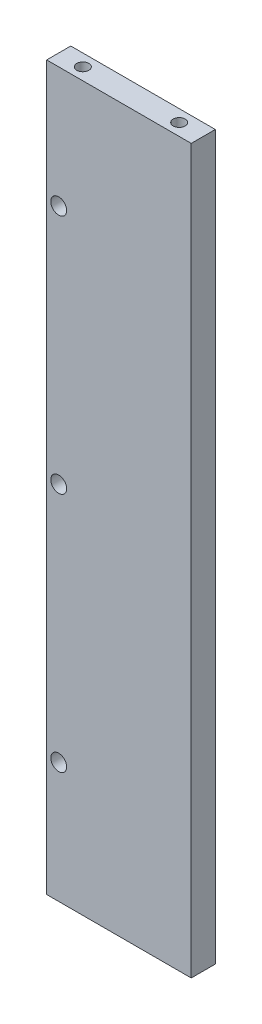
ISO-10303-21;
HEADER;
FILE_DESCRIPTION(('STEP AP214'),'2;1');
FILE_NAME('part.step','',(''),(''),'','','');
FILE_SCHEMA(('AUTOMOTIVE_DESIGN { 1 0 10303 214 1 1 1 1 }'));
ENDSEC;
DATA;
#1=APPLICATION_CONTEXT('core data for automotive mechanical design processes');
#2=APPLICATION_PROTOCOL_DEFINITION('international standard','automotive_design',2000,#1);
#3=PRODUCT_CONTEXT('',#1,'mechanical');
#4=PRODUCT('Part','Part','',(#3));
#5=PRODUCT_RELATED_PRODUCT_CATEGORY('part','',(#4));
#6=PRODUCT_DEFINITION_FORMATION('','',#4);
#7=PRODUCT_DEFINITION_CONTEXT('part definition',#1,'design');
#8=PRODUCT_DEFINITION('design','',#6,#7);
#9=PRODUCT_DEFINITION_SHAPE('','',#8);
#10=(LENGTH_UNIT() NAMED_UNIT(*) SI_UNIT(.MILLI.,.METRE.));
#11=(NAMED_UNIT(*) PLANE_ANGLE_UNIT() SI_UNIT($,.RADIAN.));
#12=(NAMED_UNIT(*) SI_UNIT($,.STERADIAN.) SOLID_ANGLE_UNIT());
#13=UNCERTAINTY_MEASURE_WITH_UNIT(LENGTH_MEASURE(1.E-05),#10,'distance_accuracy_value','');
#14=(GEOMETRIC_REPRESENTATION_CONTEXT(3) GLOBAL_UNCERTAINTY_ASSIGNED_CONTEXT((#13)) GLOBAL_UNIT_ASSIGNED_CONTEXT((#10,
#11,#12)) REPRESENTATION_CONTEXT('',''));
#15=CARTESIAN_POINT('',(0.,0.,0.));
#16=DIRECTION('',(0.,0.,1.));
#17=DIRECTION('',(1.,0.,0.));
#18=AXIS2_PLACEMENT_3D('',#15,#16,#17);
#19=CARTESIAN_POINT('',(0.,0.,10.));
#20=DIRECTION('',(1.,0.,0.));
#21=DIRECTION('',(0.,0.,-1.));
#22=AXIS2_PLACEMENT_3D('',#19,#20,#21);
#23=PLANE('',#22);
#24=DIRECTION('',(0.,-1.,0.));
#25=VECTOR('',#24,1.);
#26=CARTESIAN_POINT('',(0.,0.,0.));
#27=LINE('',#26,#25);
#28=CARTESIAN_POINT('',(0.,300.,0.));
#29=VERTEX_POINT('',#28);
#30=CARTESIAN_POINT('',(0.,0.,0.));
#31=VERTEX_POINT('',#30);
#32=EDGE_CURVE('E136',#29,#31,#27,.T.);
#33=ORIENTED_EDGE('',*,*,#32,.T.);
#34=DIRECTION('',(0.,0.,-1.));
#35=VECTOR('',#34,1.);
#36=CARTESIAN_POINT('',(0.,0.,10.));
#37=LINE('',#36,#35);
#38=CARTESIAN_POINT('',(0.,0.,10.));
#39=VERTEX_POINT('',#38);
#40=EDGE_CURVE('E11',#39,#31,#37,.T.);
#41=ORIENTED_EDGE('',*,*,#40,.F.);
#42=DIRECTION('',(0.,-1.,0.));
#43=VECTOR('',#42,1.);
#44=CARTESIAN_POINT('',(0.,0.,10.));
#45=LINE('',#44,#43);
#46=CARTESIAN_POINT('',(0.,300.,10.));
#47=VERTEX_POINT('',#46);
#48=EDGE_CURVE('E137',#47,#39,#45,.T.);
#49=ORIENTED_EDGE('',*,*,#48,.F.);
#50=DIRECTION('',(0.,0.,-1.));
#51=VECTOR('',#50,1.);
#52=CARTESIAN_POINT('',(0.,300.,10.));
#53=LINE('',#52,#51);
#54=EDGE_CURVE('E143',#47,#29,#53,.T.);
#55=ORIENTED_EDGE('',*,*,#54,.T.);
#56=EDGE_LOOP('',(#33,#41,#49,#55));
#57=FACE_BOUND('',#56,.T.);
#58=ADVANCED_FACE('F41',(#57),#23,.F.);
#59=CARTESIAN_POINT('',(0.,0.,10.));
#60=DIRECTION('',(0.,1.,0.));
#61=DIRECTION('',(0.,0.,1.));
#62=AXIS2_PLACEMENT_3D('',#59,#60,#61);
#63=PLANE('',#62);
#64=CARTESIAN_POINT('',(50.,0.,5.));
#65=DIRECTION('',(0.,-1.,0.));
#66=DIRECTION('',(0.,0.,-1.));
#67=AXIS2_PLACEMENT_3D('',#64,#65,#66);
#68=CIRCLE('',#67,2.49999999999999);
#69=CARTESIAN_POINT('',(50.,0.,2.50000000000001));
#70=VERTEX_POINT('',#69);
#71=EDGE_CURVE('E124',#70,#70,#68,.T.);
#72=ORIENTED_EDGE('',*,*,#71,.F.);
#73=EDGE_LOOP('',(#72));
#74=FACE_BOUND('',#73,.T.);
#75=CARTESIAN_POINT('',(10.,0.,5.));
#76=DIRECTION('',(0.,-1.,0.));
#77=DIRECTION('',(0.,0.,-1.));
#78=AXIS2_PLACEMENT_3D('',#75,#76,#77);
#79=CIRCLE('',#78,2.49999999999999);
#80=CARTESIAN_POINT('',(10.,0.,2.50000000000001));
#81=VERTEX_POINT('',#80);
#82=EDGE_CURVE('E130',#81,#81,#79,.T.);
#83=ORIENTED_EDGE('',*,*,#82,.F.);
#84=EDGE_LOOP('',(#83));
#85=FACE_BOUND('',#84,.T.);
#86=DIRECTION('',(1.,0.,0.));
#87=VECTOR('',#86,1.);
#88=CARTESIAN_POINT('',(0.,0.,0.));
#89=LINE('',#88,#87);
#90=CARTESIAN_POINT('',(60.,0.,0.));
#91=VERTEX_POINT('',#90);
#92=EDGE_CURVE('E146',#31,#91,#89,.T.);
#93=ORIENTED_EDGE('',*,*,#92,.T.);
#94=DIRECTION('',(0.,0.,-1.));
#95=VECTOR('',#94,1.);
#96=CARTESIAN_POINT('',(60.,0.,10.));
#97=LINE('',#96,#95);
#98=CARTESIAN_POINT('',(60.,0.,10.));
#99=VERTEX_POINT('',#98);
#100=EDGE_CURVE('E49',#99,#91,#97,.T.);
#101=ORIENTED_EDGE('',*,*,#100,.F.);
#102=DIRECTION('',(1.,0.,0.));
#103=VECTOR('',#102,1.);
#104=CARTESIAN_POINT('',(0.,0.,10.));
#105=LINE('',#104,#103);
#106=EDGE_CURVE('E88',#39,#99,#105,.T.);
#107=ORIENTED_EDGE('',*,*,#106,.F.);
#108=ORIENTED_EDGE('',*,*,#40,.T.);
#109=EDGE_LOOP('',(#93,#101,#107,#108));
#110=FACE_BOUND('',#109,.T.);
#111=ADVANCED_FACE('F171',(#74,#85,#110),#63,.F.);
#112=CARTESIAN_POINT('',(60.,0.,10.));
#113=DIRECTION('',(-1.,0.,0.));
#114=DIRECTION('',(0.,0.,1.));
#115=AXIS2_PLACEMENT_3D('',#112,#113,#114);
#116=PLANE('',#115);
#117=DIRECTION('',(0.,1.,0.));
#118=VECTOR('',#117,1.);
#119=CARTESIAN_POINT('',(60.,0.,0.));
#120=LINE('',#119,#118);
#121=CARTESIAN_POINT('',(60.,300.,0.));
#122=VERTEX_POINT('',#121);
#123=EDGE_CURVE('E75',#91,#122,#120,.T.);
#124=ORIENTED_EDGE('',*,*,#123,.T.);
#125=DIRECTION('',(0.,0.,-1.));
#126=VECTOR('',#125,1.);
#127=CARTESIAN_POINT('',(60.,300.,10.));
#128=LINE('',#127,#126);
#129=CARTESIAN_POINT('',(60.,300.,10.));
#130=VERTEX_POINT('',#129);
#131=EDGE_CURVE('E151',#130,#122,#128,.T.);
#132=ORIENTED_EDGE('',*,*,#131,.F.);
#133=DIRECTION('',(0.,1.,0.));
#134=VECTOR('',#133,1.);
#135=CARTESIAN_POINT('',(60.,0.,10.));
#136=LINE('',#135,#134);
#137=EDGE_CURVE('E140',#99,#130,#136,.T.);
#138=ORIENTED_EDGE('',*,*,#137,.F.);
#139=ORIENTED_EDGE('',*,*,#100,.T.);
#140=EDGE_LOOP('',(#124,#132,#138,#139));
#141=FACE_BOUND('',#140,.T.);
#142=ADVANCED_FACE('F153',(#141),#116,.F.);
#143=CARTESIAN_POINT('',(0.,300.,10.));
#144=DIRECTION('',(0.,-1.,0.));
#145=DIRECTION('',(0.,0.,-1.));
#146=AXIS2_PLACEMENT_3D('',#143,#144,#145);
#147=PLANE('',#146);
#148=CARTESIAN_POINT('',(10.,300.,5.));
#149=DIRECTION('',(0.,1.,0.));
#150=DIRECTION('',(0.,0.,1.));
#151=AXIS2_PLACEMENT_3D('',#148,#149,#150);
#152=CIRCLE('',#151,2.49999999999999);
#153=CARTESIAN_POINT('',(10.,300.,7.49999999999999));
#154=VERTEX_POINT('',#153);
#155=EDGE_CURVE('E112',#154,#154,#152,.T.);
#156=ORIENTED_EDGE('',*,*,#155,.F.);
#157=EDGE_LOOP('',(#156));
#158=FACE_BOUND('',#157,.T.);
#159=CARTESIAN_POINT('',(50.,300.,5.));
#160=DIRECTION('',(0.,1.,0.));
#161=DIRECTION('',(0.,0.,1.));
#162=AXIS2_PLACEMENT_3D('',#159,#160,#161);
#163=CIRCLE('',#162,2.49999999999999);
#164=CARTESIAN_POINT('',(50.,300.,7.49999999999999));
#165=VERTEX_POINT('',#164);
#166=EDGE_CURVE('E111',#165,#165,#163,.T.);
#167=ORIENTED_EDGE('',*,*,#166,.F.);
#168=EDGE_LOOP('',(#167));
#169=FACE_BOUND('',#168,.T.);
#170=DIRECTION('',(-1.,0.,0.));
#171=VECTOR('',#170,1.);
#172=CARTESIAN_POINT('',(0.,300.,0.));
#173=LINE('',#172,#171);
#174=EDGE_CURVE('E81',#122,#29,#173,.T.);
#175=ORIENTED_EDGE('',*,*,#174,.T.);
#176=ORIENTED_EDGE('',*,*,#54,.F.);
#177=DIRECTION('',(-1.,0.,0.));
#178=VECTOR('',#177,1.);
#179=CARTESIAN_POINT('',(0.,300.,10.));
#180=LINE('',#179,#178);
#181=EDGE_CURVE('E57',#130,#47,#180,.T.);
#182=ORIENTED_EDGE('',*,*,#181,.F.);
#183=ORIENTED_EDGE('',*,*,#131,.T.);
#184=EDGE_LOOP('',(#175,#176,#182,#183));
#185=FACE_BOUND('',#184,.T.);
#186=ADVANCED_FACE('F160',(#158,#169,#185),#147,.F.);
#187=CARTESIAN_POINT('',(0.,0.,10.));
#188=DIRECTION('',(0.,0.,-1.));
#189=DIRECTION('',(-1.,0.,0.));
#190=AXIS2_PLACEMENT_3D('',#187,#188,#189);
#191=PLANE('',#190);
#192=CARTESIAN_POINT('',(5.,50.,10.));
#193=DIRECTION('',(0.,0.,-1.));
#194=DIRECTION('',(-1.,0.,0.));
#195=AXIS2_PLACEMENT_3D('',#192,#193,#194);
#196=CIRCLE('',#195,3.3);
#197=CARTESIAN_POINT('',(1.7,50.,10.));
#198=VERTEX_POINT('',#197);
#199=EDGE_CURVE('E227',#198,#198,#196,.T.);
#200=ORIENTED_EDGE('',*,*,#199,.T.);
#201=EDGE_LOOP('',(#200));
#202=FACE_BOUND('',#201,.T.);
#203=CARTESIAN_POINT('',(5.,150.,10.));
#204=DIRECTION('',(0.,0.,-1.));
#205=DIRECTION('',(-1.,0.,0.));
#206=AXIS2_PLACEMENT_3D('',#203,#204,#205);
#207=CIRCLE('',#206,3.3);
#208=CARTESIAN_POINT('',(1.7,150.,10.));
#209=VERTEX_POINT('',#208);
#210=EDGE_CURVE('E220',#209,#209,#207,.T.);
#211=ORIENTED_EDGE('',*,*,#210,.T.);
#212=EDGE_LOOP('',(#211));
#213=FACE_BOUND('',#212,.T.);
#214=CARTESIAN_POINT('',(5.,250.,10.));
#215=DIRECTION('',(0.,0.,-1.));
#216=DIRECTION('',(-1.,0.,0.));
#217=AXIS2_PLACEMENT_3D('',#214,#215,#216);
#218=CIRCLE('',#217,3.3);
#219=CARTESIAN_POINT('',(1.7,250.,10.));
#220=VERTEX_POINT('',#219);
#221=EDGE_CURVE('E118',#220,#220,#218,.T.);
#222=ORIENTED_EDGE('',*,*,#221,.T.);
#223=EDGE_LOOP('',(#222));
#224=FACE_BOUND('',#223,.T.);
#225=ORIENTED_EDGE('',*,*,#48,.T.);
#226=ORIENTED_EDGE('',*,*,#106,.T.);
#227=ORIENTED_EDGE('',*,*,#137,.T.);
#228=ORIENTED_EDGE('',*,*,#181,.T.);
#229=EDGE_LOOP('',(#225,#226,#227,#228));
#230=FACE_BOUND('',#229,.T.);
#231=ADVANCED_FACE('F162',(#202,#213,#224,#230),#191,.F.);
#232=CARTESIAN_POINT('',(0.,0.,0.));
#233=DIRECTION('',(0.,0.,-1.));
#234=DIRECTION('',(-1.,0.,0.));
#235=AXIS2_PLACEMENT_3D('',#232,#233,#234);
#236=PLANE('',#235);
#237=CARTESIAN_POINT('',(5.,50.,0.));
#238=DIRECTION('',(0.,0.,-1.));
#239=DIRECTION('',(-1.,0.,0.));
#240=AXIS2_PLACEMENT_3D('',#237,#238,#239);
#241=CIRCLE('',#240,3.29999999999999);
#242=CARTESIAN_POINT('',(1.70000000000001,50.,0.));
#243=VERTEX_POINT('',#242);
#244=EDGE_CURVE('E211',#243,#243,#241,.T.);
#245=ORIENTED_EDGE('',*,*,#244,.F.);
#246=EDGE_LOOP('',(#245));
#247=FACE_BOUND('',#246,.T.);
#248=CARTESIAN_POINT('',(5.,150.,0.));
#249=DIRECTION('',(0.,0.,-1.));
#250=DIRECTION('',(-1.,0.,0.));
#251=AXIS2_PLACEMENT_3D('',#248,#249,#250);
#252=CIRCLE('',#251,3.29999999999999);
#253=CARTESIAN_POINT('',(1.70000000000001,150.,0.));
#254=VERTEX_POINT('',#253);
#255=EDGE_CURVE('E215',#254,#254,#252,.T.);
#256=ORIENTED_EDGE('',*,*,#255,.F.);
#257=EDGE_LOOP('',(#256));
#258=FACE_BOUND('',#257,.T.);
#259=CARTESIAN_POINT('',(5.,250.,0.));
#260=DIRECTION('',(0.,0.,-1.));
#261=DIRECTION('',(-1.,0.,0.));
#262=AXIS2_PLACEMENT_3D('',#259,#260,#261);
#263=CIRCLE('',#262,3.29999999999999);
#264=CARTESIAN_POINT('',(1.70000000000001,250.,0.));
#265=VERTEX_POINT('',#264);
#266=EDGE_CURVE('E218',#265,#265,#263,.T.);
#267=ORIENTED_EDGE('',*,*,#266,.F.);
#268=EDGE_LOOP('',(#267));
#269=FACE_BOUND('',#268,.T.);
#270=ORIENTED_EDGE('',*,*,#32,.F.);
#271=ORIENTED_EDGE('',*,*,#174,.F.);
#272=ORIENTED_EDGE('',*,*,#123,.F.);
#273=ORIENTED_EDGE('',*,*,#92,.F.);
#274=EDGE_LOOP('',(#270,#271,#272,#273));
#275=FACE_BOUND('',#274,.T.);
#276=ADVANCED_FACE('F156',(#247,#258,#269,#275),#236,.T.);
#277=CARTESIAN_POINT('',(10.,23.,5.));
#278=DIRECTION('',(0.,-1.,0.));
#279=DIRECTION('',(0.,0.,-1.));
#280=AXIS2_PLACEMENT_3D('',#277,#278,#279);
#281=CONICAL_SURFACE('',#280,2.5,1.02974425867665);
#282=CARTESIAN_POINT('',(9.99999999999999,24.5021515475689,5.));
#283=VERTEX_POINT('',#282);
#284=VERTEX_LOOP('',#283);
#285=FACE_BOUND('',#284,.T.);
#286=CARTESIAN_POINT('',(10.,23.,5.));
#287=DIRECTION('',(0.,-1.,0.));
#288=DIRECTION('',(0.,0.,-1.));
#289=AXIS2_PLACEMENT_3D('',#286,#287,#288);
#290=CIRCLE('',#289,2.5);
#291=CARTESIAN_POINT('',(10.,23.,2.5));
#292=VERTEX_POINT('',#291);
#293=EDGE_CURVE('E133',#292,#292,#290,.T.);
#294=ORIENTED_EDGE('',*,*,#293,.T.);
#295=EDGE_LOOP('',(#294));
#296=FACE_BOUND('',#295,.T.);
#297=ADVANCED_FACE('F190',(#285,#296),#281,.F.);
#298=CARTESIAN_POINT('',(10.,0.,5.));
#299=DIRECTION('',(0.,-1.,0.));
#300=DIRECTION('',(0.,0.,-1.));
#301=AXIS2_PLACEMENT_3D('',#298,#299,#300);
#302=CYLINDRICAL_SURFACE('',#301,2.49999999999999);
#303=ORIENTED_EDGE('',*,*,#293,.F.);
#304=EDGE_LOOP('',(#303));
#305=FACE_BOUND('',#304,.T.);
#306=ORIENTED_EDGE('',*,*,#82,.T.);
#307=EDGE_LOOP('',(#306));
#308=FACE_BOUND('',#307,.T.);
#309=ADVANCED_FACE('F187',(#305,#308),#302,.F.);
#310=CARTESIAN_POINT('',(50.,23.,5.));
#311=DIRECTION('',(0.,-1.,0.));
#312=DIRECTION('',(0.,0.,-1.));
#313=AXIS2_PLACEMENT_3D('',#310,#311,#312);
#314=CONICAL_SURFACE('',#313,2.5,1.02974425867665);
#315=CARTESIAN_POINT('',(50.,24.5021515475689,5.));
#316=VERTEX_POINT('',#315);
#317=VERTEX_LOOP('',#316);
#318=FACE_BOUND('',#317,.T.);
#319=CARTESIAN_POINT('',(50.,23.,5.));
#320=DIRECTION('',(0.,-1.,0.));
#321=DIRECTION('',(0.,0.,-1.));
#322=AXIS2_PLACEMENT_3D('',#319,#320,#321);
#323=CIRCLE('',#322,2.5);
#324=CARTESIAN_POINT('',(50.,23.,2.5));
#325=VERTEX_POINT('',#324);
#326=EDGE_CURVE('E127',#325,#325,#323,.T.);
#327=ORIENTED_EDGE('',*,*,#326,.T.);
#328=EDGE_LOOP('',(#327));
#329=FACE_BOUND('',#328,.T.);
#330=ADVANCED_FACE('F189',(#318,#329),#314,.F.);
#331=CARTESIAN_POINT('',(50.,0.,5.));
#332=DIRECTION('',(0.,-1.,0.));
#333=DIRECTION('',(0.,0.,-1.));
#334=AXIS2_PLACEMENT_3D('',#331,#332,#333);
#335=CYLINDRICAL_SURFACE('',#334,2.49999999999999);
#336=ORIENTED_EDGE('',*,*,#326,.F.);
#337=EDGE_LOOP('',(#336));
#338=FACE_BOUND('',#337,.T.);
#339=ORIENTED_EDGE('',*,*,#71,.T.);
#340=EDGE_LOOP('',(#339));
#341=FACE_BOUND('',#340,.T.);
#342=ADVANCED_FACE('F197',(#338,#341),#335,.F.);
#343=CARTESIAN_POINT('',(50.,277.,5.));
#344=DIRECTION('',(0.,1.,0.));
#345=DIRECTION('',(0.,0.,1.));
#346=AXIS2_PLACEMENT_3D('',#343,#344,#345);
#347=CONICAL_SURFACE('',#346,2.5,1.02974425867666);
#348=CARTESIAN_POINT('',(50.,275.497848452431,5.));
#349=VERTEX_POINT('',#348);
#350=VERTEX_LOOP('',#349);
#351=FACE_BOUND('',#350,.T.);
#352=CARTESIAN_POINT('',(50.,277.,5.));
#353=DIRECTION('',(0.,1.,0.));
#354=DIRECTION('',(0.,0.,1.));
#355=AXIS2_PLACEMENT_3D('',#352,#353,#354);
#356=CIRCLE('',#355,2.5);
#357=CARTESIAN_POINT('',(50.,277.,7.5));
#358=VERTEX_POINT('',#357);
#359=EDGE_CURVE('E115',#358,#358,#356,.T.);
#360=ORIENTED_EDGE('',*,*,#359,.T.);
#361=EDGE_LOOP('',(#360));
#362=FACE_BOUND('',#361,.T.);
#363=ADVANCED_FACE('F251',(#351,#362),#347,.F.);
#364=CARTESIAN_POINT('',(50.,300.,5.));
#365=DIRECTION('',(0.,1.,0.));
#366=DIRECTION('',(0.,0.,1.));
#367=AXIS2_PLACEMENT_3D('',#364,#365,#366);
#368=CYLINDRICAL_SURFACE('',#367,2.49999999999999);
#369=ORIENTED_EDGE('',*,*,#359,.F.);
#370=EDGE_LOOP('',(#369));
#371=FACE_BOUND('',#370,.T.);
#372=ORIENTED_EDGE('',*,*,#166,.T.);
#373=EDGE_LOOP('',(#372));
#374=FACE_BOUND('',#373,.T.);
#375=ADVANCED_FACE('F105',(#371,#374),#368,.F.);
#376=CARTESIAN_POINT('',(10.,277.,5.));
#377=DIRECTION('',(0.,1.,0.));
#378=DIRECTION('',(0.,0.,1.));
#379=AXIS2_PLACEMENT_3D('',#376,#377,#378);
#380=CONICAL_SURFACE('',#379,2.5,1.02974425867666);
#381=CARTESIAN_POINT('',(10.,275.497848452431,5.));
#382=VERTEX_POINT('',#381);
#383=VERTEX_LOOP('',#382);
#384=FACE_BOUND('',#383,.T.);
#385=CARTESIAN_POINT('',(10.,277.,5.));
#386=DIRECTION('',(0.,1.,0.));
#387=DIRECTION('',(0.,0.,1.));
#388=AXIS2_PLACEMENT_3D('',#385,#386,#387);
#389=CIRCLE('',#388,2.5);
#390=CARTESIAN_POINT('',(10.,277.,7.49999999999999));
#391=VERTEX_POINT('',#390);
#392=EDGE_CURVE('E109',#391,#391,#389,.T.);
#393=ORIENTED_EDGE('',*,*,#392,.T.);
#394=EDGE_LOOP('',(#393));
#395=FACE_BOUND('',#394,.T.);
#396=ADVANCED_FACE('F101',(#384,#395),#380,.F.);
#397=CARTESIAN_POINT('',(10.,300.,5.));
#398=DIRECTION('',(0.,1.,0.));
#399=DIRECTION('',(0.,0.,1.));
#400=AXIS2_PLACEMENT_3D('',#397,#398,#399);
#401=CYLINDRICAL_SURFACE('',#400,2.49999999999999);
#402=ORIENTED_EDGE('',*,*,#392,.F.);
#403=EDGE_LOOP('',(#402));
#404=FACE_BOUND('',#403,.T.);
#405=ORIENTED_EDGE('',*,*,#155,.T.);
#406=EDGE_LOOP('',(#405));
#407=FACE_BOUND('',#406,.T.);
#408=ADVANCED_FACE('F104',(#404,#407),#401,.F.);
#409=CARTESIAN_POINT('',(5.,250.,0.));
#410=DIRECTION('',(0.,0.,-1.));
#411=DIRECTION('',(-1.,0.,0.));
#412=AXIS2_PLACEMENT_3D('',#409,#410,#411);
#413=CYLINDRICAL_SURFACE('',#412,3.29999999999999);
#414=ORIENTED_EDGE('',*,*,#221,.F.);
#415=EDGE_LOOP('',(#414));
#416=FACE_BOUND('',#415,.T.);
#417=ORIENTED_EDGE('',*,*,#266,.T.);
#418=EDGE_LOOP('',(#417));
#419=FACE_BOUND('',#418,.T.);
#420=ADVANCED_FACE('F239',(#416,#419),#413,.F.);
#421=CARTESIAN_POINT('',(5.,150.,0.));
#422=DIRECTION('',(0.,0.,-1.));
#423=DIRECTION('',(-1.,0.,0.));
#424=AXIS2_PLACEMENT_3D('',#421,#422,#423);
#425=CYLINDRICAL_SURFACE('',#424,3.29999999999999);
#426=ORIENTED_EDGE('',*,*,#210,.F.);
#427=EDGE_LOOP('',(#426));
#428=FACE_BOUND('',#427,.T.);
#429=ORIENTED_EDGE('',*,*,#255,.T.);
#430=EDGE_LOOP('',(#429));
#431=FACE_BOUND('',#430,.T.);
#432=ADVANCED_FACE('F233',(#428,#431),#425,.F.);
#433=CARTESIAN_POINT('',(5.,50.,0.));
#434=DIRECTION('',(0.,0.,-1.));
#435=DIRECTION('',(-1.,0.,0.));
#436=AXIS2_PLACEMENT_3D('',#433,#434,#435);
#437=CYLINDRICAL_SURFACE('',#436,3.29999999999999);
#438=ORIENTED_EDGE('',*,*,#199,.F.);
#439=EDGE_LOOP('',(#438));
#440=FACE_BOUND('',#439,.T.);
#441=ORIENTED_EDGE('',*,*,#244,.T.);
#442=EDGE_LOOP('',(#441));
#443=FACE_BOUND('',#442,.T.);
#444=ADVANCED_FACE('F231',(#440,#443),#437,.F.);
#445=CLOSED_SHELL('',(#58,#111,#142,#186,#231,#276,#297,#309,#330,#342,#363,#375,#396,#408,#420,
#432,#444));
#446=MANIFOLD_SOLID_BREP('B2',#445);
#447=ADVANCED_BREP_SHAPE_REPRESENTATION('',(#18,#446),#14);
#448=SHAPE_DEFINITION_REPRESENTATION(#9,#447);
ENDSEC;
END-ISO-10303-21;
